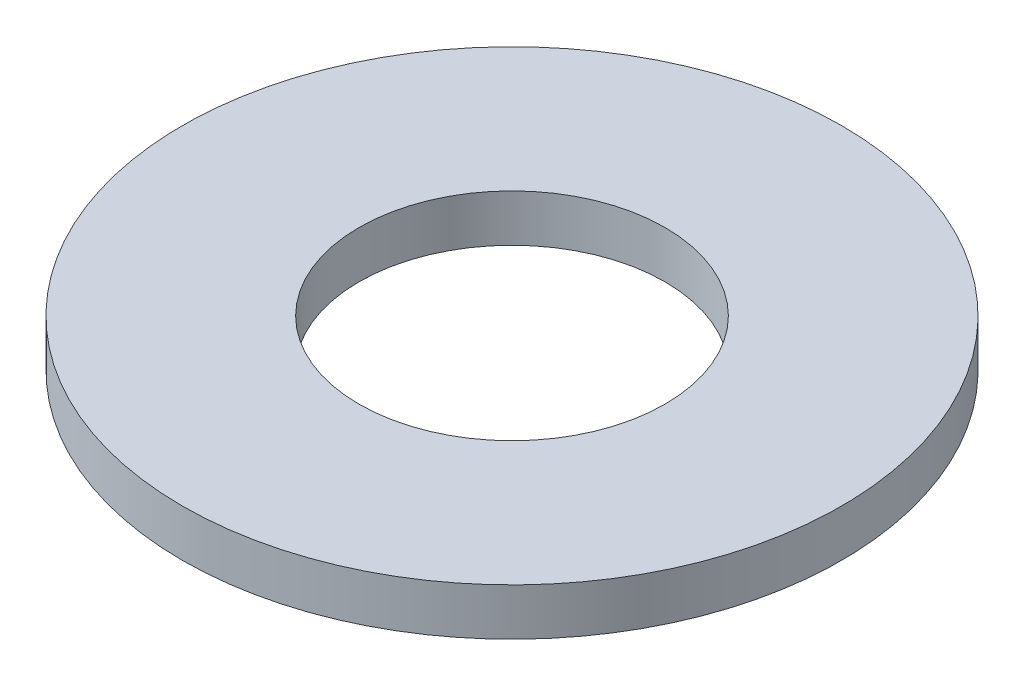
ISO-10303-21;
HEADER;
FILE_DESCRIPTION(('STEP AP214'),'2;1');
FILE_NAME('part.step','',(''),(''),'','','');
FILE_SCHEMA(('AUTOMOTIVE_DESIGN { 1 0 10303 214 1 1 1 1 }'));
ENDSEC;
DATA;
#1=APPLICATION_CONTEXT('core data for automotive mechanical design processes');
#2=APPLICATION_PROTOCOL_DEFINITION('international standard','automotive_design',2000,#1);
#3=PRODUCT_CONTEXT('',#1,'mechanical');
#4=PRODUCT('Part','Part','',(#3));
#5=PRODUCT_RELATED_PRODUCT_CATEGORY('part','',(#4));
#6=PRODUCT_DEFINITION_FORMATION('','',#4);
#7=PRODUCT_DEFINITION_CONTEXT('part definition',#1,'design');
#8=PRODUCT_DEFINITION('design','',#6,#7);
#9=PRODUCT_DEFINITION_SHAPE('','',#8);
#10=(LENGTH_UNIT() NAMED_UNIT(*) SI_UNIT(.MILLI.,.METRE.));
#11=(NAMED_UNIT(*) PLANE_ANGLE_UNIT() SI_UNIT($,.RADIAN.));
#12=(NAMED_UNIT(*) SI_UNIT($,.STERADIAN.) SOLID_ANGLE_UNIT());
#13=UNCERTAINTY_MEASURE_WITH_UNIT(LENGTH_MEASURE(1.E-05),#10,'distance_accuracy_value','');
#14=(GEOMETRIC_REPRESENTATION_CONTEXT(3) GLOBAL_UNCERTAINTY_ASSIGNED_CONTEXT((#13)) GLOBAL_UNIT_ASSIGNED_CONTEXT((#10,
#11,#12)) REPRESENTATION_CONTEXT('',''));
#15=CARTESIAN_POINT('',(0.,0.,0.));
#16=DIRECTION('',(0.,0.,1.));
#17=DIRECTION('',(1.,0.,0.));
#18=AXIS2_PLACEMENT_3D('',#15,#16,#17);
#19=CARTESIAN_POINT('',(0.,10.,0.));
#20=DIRECTION('',(0.,-1.,0.));
#21=DIRECTION('',(0.,0.,-1.));
#22=AXIS2_PLACEMENT_3D('',#19,#20,#21);
#23=CYLINDRICAL_SURFACE('',#22,70.);
#24=CARTESIAN_POINT('',(0.,10.,0.));
#25=DIRECTION('',(0.,1.,0.));
#26=DIRECTION('',(0.,0.,1.));
#27=AXIS2_PLACEMENT_3D('',#24,#25,#26);
#28=CIRCLE('',#27,70.);
#29=CARTESIAN_POINT('',(0.,10.,70.));
#30=VERTEX_POINT('',#29);
#31=EDGE_CURVE('E10',#30,#30,#28,.T.);
#32=ORIENTED_EDGE('',*,*,#31,.F.);
#33=EDGE_LOOP('',(#32));
#34=FACE_BOUND('',#33,.T.);
#35=CARTESIAN_POINT('',(0.,0.,0.));
#36=DIRECTION('',(0.,1.,0.));
#37=DIRECTION('',(0.,0.,1.));
#38=AXIS2_PLACEMENT_3D('',#35,#36,#37);
#39=CIRCLE('',#38,70.);
#40=CARTESIAN_POINT('',(0.,0.,70.));
#41=VERTEX_POINT('',#40);
#42=EDGE_CURVE('E37',#41,#41,#39,.T.);
#43=ORIENTED_EDGE('',*,*,#42,.T.);
#44=EDGE_LOOP('',(#43));
#45=FACE_BOUND('',#44,.T.);
#46=ADVANCED_FACE('F40',(#34,#45),#23,.T.);
#47=CARTESIAN_POINT('',(0.,10.,0.));
#48=DIRECTION('',(0.,1.,0.));
#49=DIRECTION('',(0.,0.,1.));
#50=AXIS2_PLACEMENT_3D('',#47,#48,#49);
#51=PLANE('',#50);
#52=CARTESIAN_POINT('',(0.,10.,0.));
#53=DIRECTION('',(0.,1.,0.));
#54=DIRECTION('',(0.,0.,1.));
#55=AXIS2_PLACEMENT_3D('',#52,#53,#54);
#56=CIRCLE('',#55,32.5);
#57=CARTESIAN_POINT('',(0.,10.,32.5));
#58=VERTEX_POINT('',#57);
#59=EDGE_CURVE('E50',#58,#58,#56,.T.);
#60=ORIENTED_EDGE('',*,*,#59,.F.);
#61=EDGE_LOOP('',(#60));
#62=FACE_BOUND('',#61,.T.);
#63=ORIENTED_EDGE('',*,*,#31,.T.);
#64=EDGE_LOOP('',(#63));
#65=FACE_BOUND('',#64,.T.);
#66=ADVANCED_FACE('F59',(#62,#65),#51,.T.);
#67=CARTESIAN_POINT('',(0.,0.,0.));
#68=DIRECTION('',(0.,1.,0.));
#69=DIRECTION('',(0.,0.,1.));
#70=AXIS2_PLACEMENT_3D('',#67,#68,#69);
#71=PLANE('',#70);
#72=CARTESIAN_POINT('',(0.,0.,0.));
#73=DIRECTION('',(0.,1.,0.));
#74=DIRECTION('',(0.,0.,1.));
#75=AXIS2_PLACEMENT_3D('',#72,#73,#74);
#76=CIRCLE('',#75,32.5);
#77=CARTESIAN_POINT('',(0.,0.,32.5));
#78=VERTEX_POINT('',#77);
#79=EDGE_CURVE('E47',#78,#78,#76,.T.);
#80=ORIENTED_EDGE('',*,*,#79,.T.);
#81=EDGE_LOOP('',(#80));
#82=FACE_BOUND('',#81,.T.);
#83=ORIENTED_EDGE('',*,*,#42,.F.);
#84=EDGE_LOOP('',(#83));
#85=FACE_BOUND('',#84,.T.);
#86=ADVANCED_FACE('F58',(#82,#85),#71,.F.);
#87=CARTESIAN_POINT('',(0.,10.,0.));
#88=DIRECTION('',(0.,-1.,0.));
#89=DIRECTION('',(0.,0.,-1.));
#90=AXIS2_PLACEMENT_3D('',#87,#88,#89);
#91=CYLINDRICAL_SURFACE('',#90,32.5);
#92=ORIENTED_EDGE('',*,*,#59,.T.);
#93=EDGE_LOOP('',(#92));
#94=FACE_BOUND('',#93,.T.);
#95=ORIENTED_EDGE('',*,*,#79,.F.);
#96=EDGE_LOOP('',(#95));
#97=FACE_BOUND('',#96,.T.);
#98=ADVANCED_FACE('F54',(#94,#97),#91,.F.);
#99=CLOSED_SHELL('',(#46,#66,#86,#98));
#100=MANIFOLD_SOLID_BREP('B2',#99);
#101=ADVANCED_BREP_SHAPE_REPRESENTATION('',(#18,#100),#14);
#102=SHAPE_DEFINITION_REPRESENTATION(#9,#101);
ENDSEC;
END-ISO-10303-21;
